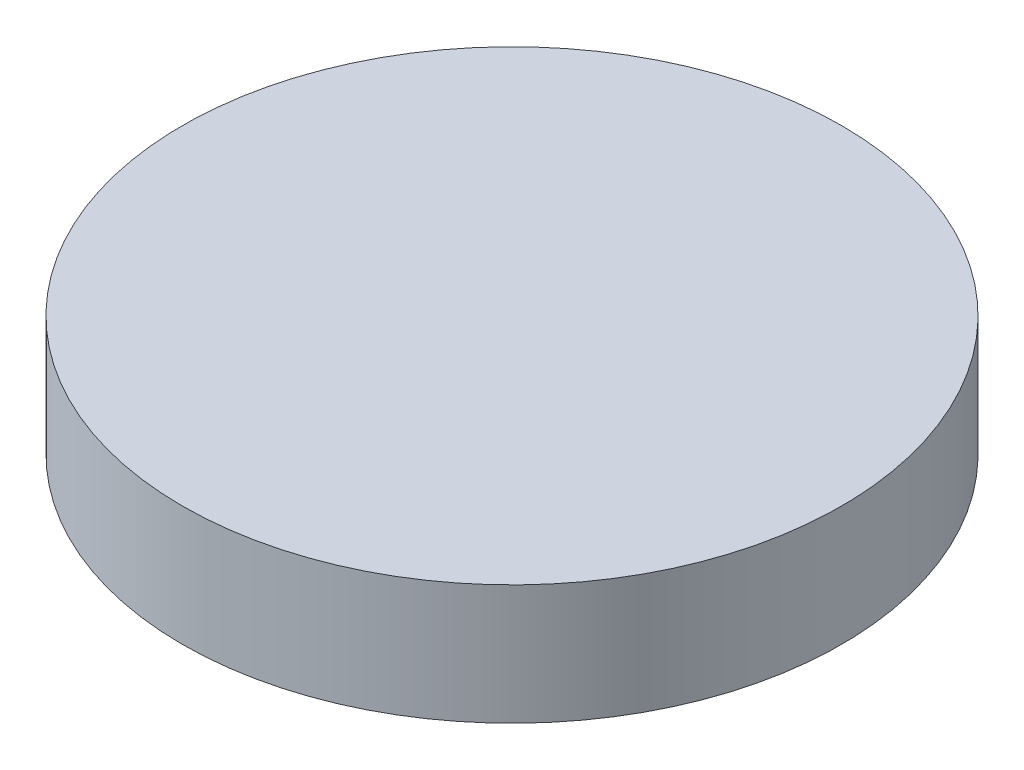
ISO-10303-21;
HEADER;
FILE_DESCRIPTION(('STEP AP214'),'2;1');
FILE_NAME('part.step','',(''),(''),'','','');
FILE_SCHEMA(('AUTOMOTIVE_DESIGN { 1 0 10303 214 1 1 1 1 }'));
ENDSEC;
DATA;
#1=APPLICATION_CONTEXT('core data for automotive mechanical design processes');
#2=APPLICATION_PROTOCOL_DEFINITION('international standard','automotive_design',2000,#1);
#3=PRODUCT_CONTEXT('',#1,'mechanical');
#4=PRODUCT('Part','Part','',(#3));
#5=PRODUCT_RELATED_PRODUCT_CATEGORY('part','',(#4));
#6=PRODUCT_DEFINITION_FORMATION('','',#4);
#7=PRODUCT_DEFINITION_CONTEXT('part definition',#1,'design');
#8=PRODUCT_DEFINITION('design','',#6,#7);
#9=PRODUCT_DEFINITION_SHAPE('','',#8);
#10=(LENGTH_UNIT() NAMED_UNIT(*) SI_UNIT(.MILLI.,.METRE.));
#11=(NAMED_UNIT(*) PLANE_ANGLE_UNIT() SI_UNIT($,.RADIAN.));
#12=(NAMED_UNIT(*) SI_UNIT($,.STERADIAN.) SOLID_ANGLE_UNIT());
#13=UNCERTAINTY_MEASURE_WITH_UNIT(LENGTH_MEASURE(1.E-05),#10,'distance_accuracy_value','');
#14=(GEOMETRIC_REPRESENTATION_CONTEXT(3) GLOBAL_UNCERTAINTY_ASSIGNED_CONTEXT((#13)) GLOBAL_UNIT_ASSIGNED_CONTEXT((#10,
#11,#12)) REPRESENTATION_CONTEXT('',''));
#15=CARTESIAN_POINT('',(0.,0.,0.));
#16=DIRECTION('',(0.,0.,1.));
#17=DIRECTION('',(1.,0.,0.));
#18=AXIS2_PLACEMENT_3D('',#15,#16,#17);
#19=CARTESIAN_POINT('',(0.,40.,0.));
#20=DIRECTION('',(0.,-1.,0.));
#21=DIRECTION('',(0.,0.,-1.));
#22=AXIS2_PLACEMENT_3D('',#19,#20,#21);
#23=CYLINDRICAL_SURFACE('',#22,110.);
#24=CARTESIAN_POINT('',(0.,40.,0.));
#25=DIRECTION('',(0.,1.,0.));
#26=DIRECTION('',(0.,0.,1.));
#27=AXIS2_PLACEMENT_3D('',#24,#25,#26);
#28=CIRCLE('',#27,110.);
#29=CARTESIAN_POINT('',(0.,40.,110.));
#30=VERTEX_POINT('',#29);
#31=EDGE_CURVE('E10',#30,#30,#28,.T.);
#32=ORIENTED_EDGE('',*,*,#31,.F.);
#33=EDGE_LOOP('',(#32));
#34=FACE_BOUND('',#33,.T.);
#35=CARTESIAN_POINT('',(0.,0.,0.));
#36=DIRECTION('',(0.,1.,0.));
#37=DIRECTION('',(0.,0.,1.));
#38=AXIS2_PLACEMENT_3D('',#35,#36,#37);
#39=CIRCLE('',#38,110.);
#40=CARTESIAN_POINT('',(0.,0.,110.));
#41=VERTEX_POINT('',#40);
#42=EDGE_CURVE('E36',#41,#41,#39,.T.);
#43=ORIENTED_EDGE('',*,*,#42,.T.);
#44=EDGE_LOOP('',(#43));
#45=FACE_BOUND('',#44,.T.);
#46=ADVANCED_FACE('F30',(#34,#45),#23,.T.);
#47=CARTESIAN_POINT('',(0.,40.,0.));
#48=DIRECTION('',(0.,1.,0.));
#49=DIRECTION('',(0.,0.,1.));
#50=AXIS2_PLACEMENT_3D('',#47,#48,#49);
#51=PLANE('',#50);
#52=ORIENTED_EDGE('',*,*,#31,.T.);
#53=EDGE_LOOP('',(#52));
#54=FACE_BOUND('',#53,.T.);
#55=ADVANCED_FACE('F45',(#54),#51,.T.);
#56=CARTESIAN_POINT('',(0.,0.,0.));
#57=DIRECTION('',(0.,1.,0.));
#58=DIRECTION('',(0.,0.,1.));
#59=AXIS2_PLACEMENT_3D('',#56,#57,#58);
#60=PLANE('',#59);
#61=ORIENTED_EDGE('',*,*,#42,.F.);
#62=EDGE_LOOP('',(#61));
#63=FACE_BOUND('',#62,.T.);
#64=ADVANCED_FACE('F43',(#63),#60,.F.);
#65=CLOSED_SHELL('',(#46,#55,#64));
#66=MANIFOLD_SOLID_BREP('B2',#65);
#67=ADVANCED_BREP_SHAPE_REPRESENTATION('',(#18,#66),#14);
#68=SHAPE_DEFINITION_REPRESENTATION(#9,#67);
ENDSEC;
END-ISO-10303-21;
